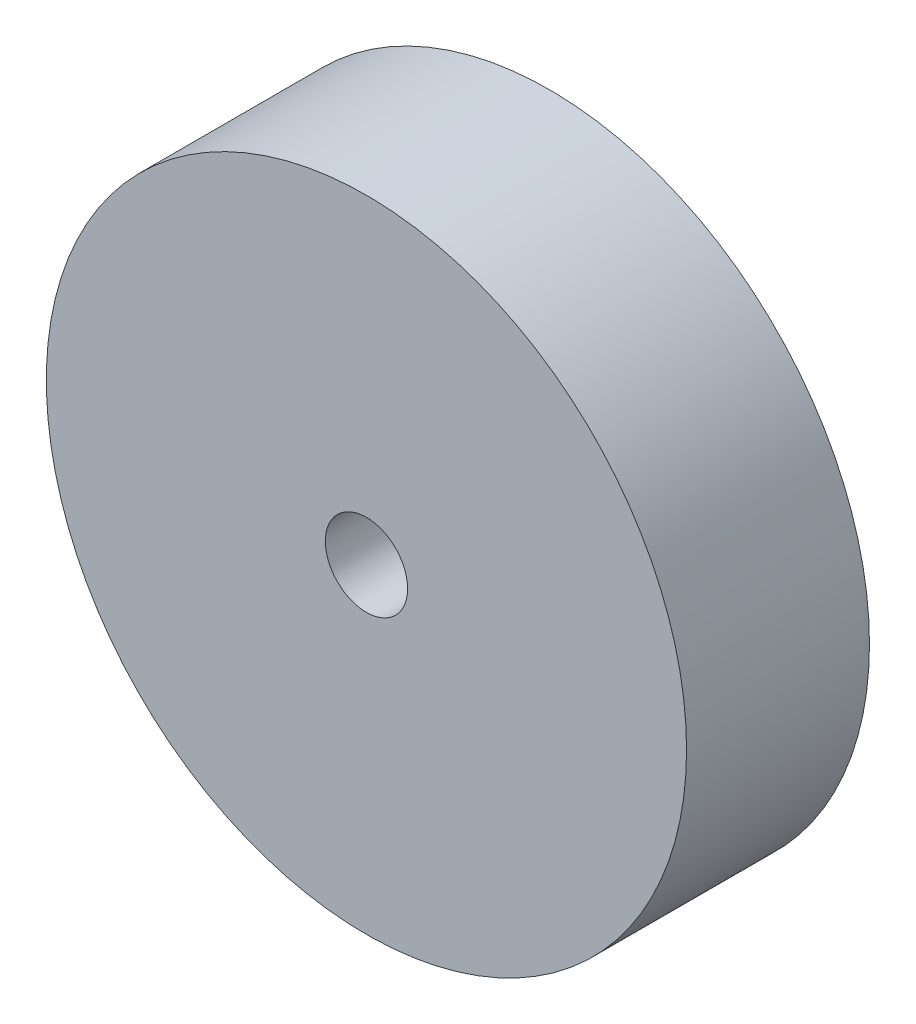
ISO-10303-21;
HEADER;
FILE_DESCRIPTION(('STEP AP214'),'2;1');
FILE_NAME('part.step','',(''),(''),'','','');
FILE_SCHEMA(('AUTOMOTIVE_DESIGN { 1 0 10303 214 1 1 1 1 }'));
ENDSEC;
DATA;
#1=APPLICATION_CONTEXT('core data for automotive mechanical design processes');
#2=APPLICATION_PROTOCOL_DEFINITION('international standard','automotive_design',2000,#1);
#3=PRODUCT_CONTEXT('',#1,'mechanical');
#4=PRODUCT('Part','Part','',(#3));
#5=PRODUCT_RELATED_PRODUCT_CATEGORY('part','',(#4));
#6=PRODUCT_DEFINITION_FORMATION('','',#4);
#7=PRODUCT_DEFINITION_CONTEXT('part definition',#1,'design');
#8=PRODUCT_DEFINITION('design','',#6,#7);
#9=PRODUCT_DEFINITION_SHAPE('','',#8);
#10=(LENGTH_UNIT() NAMED_UNIT(*) SI_UNIT(.MILLI.,.METRE.));
#11=(NAMED_UNIT(*) PLANE_ANGLE_UNIT() SI_UNIT($,.RADIAN.));
#12=(NAMED_UNIT(*) SI_UNIT($,.STERADIAN.) SOLID_ANGLE_UNIT());
#13=UNCERTAINTY_MEASURE_WITH_UNIT(LENGTH_MEASURE(1.E-05),#10,'distance_accuracy_value','');
#14=(GEOMETRIC_REPRESENTATION_CONTEXT(3) GLOBAL_UNCERTAINTY_ASSIGNED_CONTEXT((#13)) GLOBAL_UNIT_ASSIGNED_CONTEXT((#10,
#11,#12)) REPRESENTATION_CONTEXT('',''));
#15=CARTESIAN_POINT('',(0.,0.,0.));
#16=DIRECTION('',(0.,0.,1.));
#17=DIRECTION('',(1.,0.,0.));
#18=AXIS2_PLACEMENT_3D('',#15,#16,#17);
#19=CARTESIAN_POINT('',(0.,0.,20.));
#20=DIRECTION('',(0.,0.,-1.));
#21=DIRECTION('',(-1.,0.,0.));
#22=AXIS2_PLACEMENT_3D('',#19,#20,#21);
#23=CYLINDRICAL_SURFACE('',#22,35.);
#24=CARTESIAN_POINT('',(0.,0.,20.));
#25=DIRECTION('',(0.,0.,1.));
#26=DIRECTION('',(1.,0.,0.));
#27=AXIS2_PLACEMENT_3D('',#24,#25,#26);
#28=CIRCLE('',#27,35.);
#29=CARTESIAN_POINT('',(35.,0.,20.));
#30=VERTEX_POINT('',#29);
#31=EDGE_CURVE('E10',#30,#30,#28,.T.);
#32=ORIENTED_EDGE('',*,*,#31,.F.);
#33=EDGE_LOOP('',(#32));
#34=FACE_BOUND('',#33,.T.);
#35=CARTESIAN_POINT('',(0.,0.,0.));
#36=DIRECTION('',(0.,0.,1.));
#37=DIRECTION('',(1.,0.,0.));
#38=AXIS2_PLACEMENT_3D('',#35,#36,#37);
#39=CIRCLE('',#38,35.);
#40=CARTESIAN_POINT('',(35.,0.,0.));
#41=VERTEX_POINT('',#40);
#42=EDGE_CURVE('E38',#41,#41,#39,.T.);
#43=ORIENTED_EDGE('',*,*,#42,.T.);
#44=EDGE_LOOP('',(#43));
#45=FACE_BOUND('',#44,.T.);
#46=ADVANCED_FACE('F35',(#34,#45),#23,.T.);
#47=CARTESIAN_POINT('',(0.,0.,20.));
#48=DIRECTION('',(0.,0.,1.));
#49=DIRECTION('',(1.,0.,0.));
#50=AXIS2_PLACEMENT_3D('',#47,#48,#49);
#51=PLANE('',#50);
#52=CARTESIAN_POINT('',(0.,0.,20.));
#53=DIRECTION('',(0.,0.,1.));
#54=DIRECTION('',(1.,0.,0.));
#55=AXIS2_PLACEMENT_3D('',#52,#53,#54);
#56=CIRCLE('',#55,4.5);
#57=CARTESIAN_POINT('',(4.5,0.,20.));
#58=VERTEX_POINT('',#57);
#59=EDGE_CURVE('E49',#58,#58,#56,.T.);
#60=ORIENTED_EDGE('',*,*,#59,.F.);
#61=EDGE_LOOP('',(#60));
#62=FACE_BOUND('',#61,.T.);
#63=ORIENTED_EDGE('',*,*,#31,.T.);
#64=EDGE_LOOP('',(#63));
#65=FACE_BOUND('',#64,.T.);
#66=ADVANCED_FACE('F66',(#62,#65),#51,.T.);
#67=CARTESIAN_POINT('',(0.,0.,0.));
#68=DIRECTION('',(0.,0.,1.));
#69=DIRECTION('',(1.,0.,0.));
#70=AXIS2_PLACEMENT_3D('',#67,#68,#69);
#71=PLANE('',#70);
#72=CARTESIAN_POINT('',(0.,0.,0.));
#73=DIRECTION('',(0.,0.,1.));
#74=DIRECTION('',(1.,0.,0.));
#75=AXIS2_PLACEMENT_3D('',#72,#73,#74);
#76=CIRCLE('',#75,4.5);
#77=CARTESIAN_POINT('',(4.5,0.,0.));
#78=VERTEX_POINT('',#77);
#79=EDGE_CURVE('E47',#78,#78,#76,.T.);
#80=ORIENTED_EDGE('',*,*,#79,.T.);
#81=EDGE_LOOP('',(#80));
#82=FACE_BOUND('',#81,.T.);
#83=ORIENTED_EDGE('',*,*,#42,.F.);
#84=EDGE_LOOP('',(#83));
#85=FACE_BOUND('',#84,.T.);
#86=ADVANCED_FACE('F57',(#82,#85),#71,.F.);
#87=CARTESIAN_POINT('',(0.,0.,0.));
#88=DIRECTION('',(0.,0.,1.));
#89=DIRECTION('',(1.,0.,0.));
#90=AXIS2_PLACEMENT_3D('',#87,#88,#89);
#91=CYLINDRICAL_SURFACE('',#90,4.5);
#92=ORIENTED_EDGE('',*,*,#79,.F.);
#93=EDGE_LOOP('',(#92));
#94=FACE_BOUND('',#93,.T.);
#95=ORIENTED_EDGE('',*,*,#59,.T.);
#96=EDGE_LOOP('',(#95));
#97=FACE_BOUND('',#96,.T.);
#98=ADVANCED_FACE('F60',(#94,#97),#91,.F.);
#99=CLOSED_SHELL('',(#46,#66,#86,#98));
#100=MANIFOLD_SOLID_BREP('B2',#99);
#101=ADVANCED_BREP_SHAPE_REPRESENTATION('',(#18,#100),#14);
#102=SHAPE_DEFINITION_REPRESENTATION(#9,#101);
ENDSEC;
END-ISO-10303-21;
